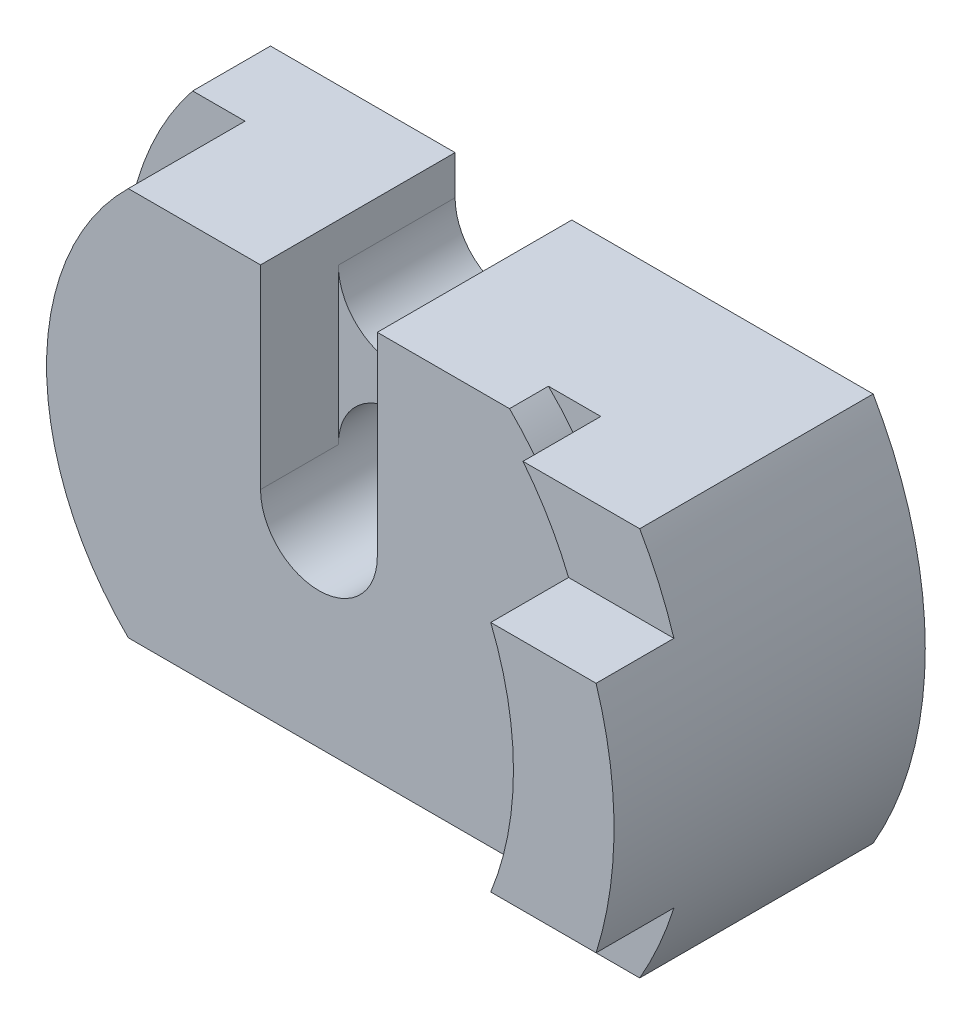
ISO-10303-21;
HEADER;
FILE_DESCRIPTION(('STEP AP214'),'2;1');
FILE_NAME('part.step','',(''),(''),'','','');
FILE_SCHEMA(('AUTOMOTIVE_DESIGN { 1 0 10303 214 1 1 1 1 }'));
ENDSEC;
DATA;
#1=APPLICATION_CONTEXT('core data for automotive mechanical design processes');
#2=APPLICATION_PROTOCOL_DEFINITION('international standard','automotive_design',2000,#1);
#3=PRODUCT_CONTEXT('',#1,'mechanical');
#4=PRODUCT('Part','Part','',(#3));
#5=PRODUCT_RELATED_PRODUCT_CATEGORY('part','',(#4));
#6=PRODUCT_DEFINITION_FORMATION('','',#4);
#7=PRODUCT_DEFINITION_CONTEXT('part definition',#1,'design');
#8=PRODUCT_DEFINITION('design','',#6,#7);
#9=PRODUCT_DEFINITION_SHAPE('','',#8);
#10=(LENGTH_UNIT() NAMED_UNIT(*) SI_UNIT(.MILLI.,.METRE.));
#11=(NAMED_UNIT(*) PLANE_ANGLE_UNIT() SI_UNIT($,.RADIAN.));
#12=(NAMED_UNIT(*) SI_UNIT($,.STERADIAN.) SOLID_ANGLE_UNIT());
#13=UNCERTAINTY_MEASURE_WITH_UNIT(LENGTH_MEASURE(1.E-05),#10,'distance_accuracy_value','');
#14=(GEOMETRIC_REPRESENTATION_CONTEXT(3) GLOBAL_UNCERTAINTY_ASSIGNED_CONTEXT((#13)) GLOBAL_UNIT_ASSIGNED_CONTEXT((#10,
#11,#12)) REPRESENTATION_CONTEXT('',''));
#15=CARTESIAN_POINT('',(0.,0.,0.));
#16=DIRECTION('',(0.,0.,1.));
#17=DIRECTION('',(1.,0.,0.));
#18=AXIS2_PLACEMENT_3D('',#15,#16,#17);
#19=CARTESIAN_POINT('',(0.,0.,5.));
#20=DIRECTION('',(0.,0.,-1.));
#21=DIRECTION('',(-1.,0.,0.));
#22=AXIS2_PLACEMENT_3D('',#19,#20,#21);
#23=CYLINDRICAL_SURFACE('',#22,7.);
#24=CARTESIAN_POINT('',(0.,0.,4.));
#25=DIRECTION('',(0.,0.,-1.));
#26=DIRECTION('',(-1.,0.,0.));
#27=AXIS2_PLACEMENT_3D('',#24,#25,#26);
#28=CIRCLE('',#27,7.00000000000004);
#29=CARTESIAN_POINT('',(4.89897948556636,5.,4.));
#30=VERTEX_POINT('',#29);
#31=CARTESIAN_POINT('',(4.89897948556635,-5.,4.));
#32=VERTEX_POINT('',#31);
#33=EDGE_CURVE('E178',#30,#32,#28,.T.);
#34=ORIENTED_EDGE('',*,*,#33,.F.);
#35=DIRECTION('',(0.,0.,-1.));
#36=VECTOR('',#35,1.);
#37=CARTESIAN_POINT('',(4.89897948556636,5.,5.));
#38=LINE('',#37,#36);
#39=CARTESIAN_POINT('',(4.89897948556636,5.,5.));
#40=VERTEX_POINT('',#39);
#41=EDGE_CURVE('E190',#40,#30,#38,.T.);
#42=ORIENTED_EDGE('',*,*,#41,.F.);
#43=CARTESIAN_POINT('',(0.,0.,5.));
#44=DIRECTION('',(0.,0.,1.));
#45=DIRECTION('',(1.,0.,0.));
#46=AXIS2_PLACEMENT_3D('',#43,#44,#45);
#47=CIRCLE('',#46,7.);
#48=CARTESIAN_POINT('',(4.89897948556635,-5.,5.));
#49=VERTEX_POINT('',#48);
#50=EDGE_CURVE('E188',#49,#40,#47,.T.);
#51=ORIENTED_EDGE('',*,*,#50,.F.);
#52=DIRECTION('',(0.,0.,-1.));
#53=VECTOR('',#52,1.);
#54=CARTESIAN_POINT('',(4.89897948556635,-5.,5.));
#55=LINE('',#54,#53);
#56=EDGE_CURVE('E173',#49,#32,#55,.T.);
#57=ORIENTED_EDGE('',*,*,#56,.T.);
#58=EDGE_LOOP('',(#34,#42,#51,#57));
#59=FACE_BOUND('',#58,.T.);
#60=ADVANCED_FACE('F33',(#59),#23,.T.);
#61=CARTESIAN_POINT('',(0.,0.,6.));
#62=DIRECTION('',(0.,0.,-1.));
#63=DIRECTION('',(-1.,0.,0.));
#64=AXIS2_PLACEMENT_3D('',#61,#62,#63);
#65=CYLINDRICAL_SURFACE('',#64,8.00000000000001);
#66=DIRECTION('',(0.,0.,-1.));
#67=VECTOR('',#66,1.);
#68=CARTESIAN_POINT('',(6.2449979983984,5.,6.));
#69=LINE('',#68,#67);
#70=CARTESIAN_POINT('',(6.2449979983984,5.,6.));
#71=VERTEX_POINT('',#70);
#72=CARTESIAN_POINT('',(6.2449979983984,5.,4.));
#73=VERTEX_POINT('',#72);
#74=EDGE_CURVE('E256',#71,#73,#69,.T.);
#75=ORIENTED_EDGE('',*,*,#74,.T.);
#76=CARTESIAN_POINT('',(0.,0.,4.));
#77=DIRECTION('',(0.,0.,1.));
#78=DIRECTION('',(-1.,0.,0.));
#79=AXIS2_PLACEMENT_3D('',#76,#77,#78);
#80=CIRCLE('',#79,8.00000000000005);
#81=CARTESIAN_POINT('',(6.2449979983984,-5.,4.));
#82=VERTEX_POINT('',#81);
#83=EDGE_CURVE('E177',#82,#73,#80,.T.);
#84=ORIENTED_EDGE('',*,*,#83,.F.);
#85=DIRECTION('',(0.,0.,-1.));
#86=VECTOR('',#85,1.);
#87=CARTESIAN_POINT('',(6.2449979983984,-5.,6.));
#88=LINE('',#87,#86);
#89=CARTESIAN_POINT('',(6.2449979983984,-5.,6.));
#90=VERTEX_POINT('',#89);
#91=EDGE_CURVE('E176',#90,#82,#88,.T.);
#92=ORIENTED_EDGE('',*,*,#91,.F.);
#93=CARTESIAN_POINT('',(0.,0.,6.));
#94=DIRECTION('',(0.,0.,1.));
#95=DIRECTION('',(-1.,0.,0.));
#96=AXIS2_PLACEMENT_3D('',#93,#94,#95);
#97=CIRCLE('',#96,8.00000000000001);
#98=CARTESIAN_POINT('',(7.41619848709566,-3.,6.));
#99=VERTEX_POINT('',#98);
#100=EDGE_CURVE('E241',#90,#99,#97,.T.);
#101=ORIENTED_EDGE('',*,*,#100,.T.);
#102=DIRECTION('',(0.,0.,-1.));
#103=VECTOR('',#102,1.);
#104=CARTESIAN_POINT('',(7.41619848709566,-3.,8.));
#105=LINE('',#104,#103);
#106=CARTESIAN_POINT('',(7.41619848709566,-3.,8.));
#107=VERTEX_POINT('',#106);
#108=EDGE_CURVE('E239',#107,#99,#105,.T.);
#109=ORIENTED_EDGE('',*,*,#108,.F.);
#110=CARTESIAN_POINT('',(-1.36175792864179E-13,0.,8.));
#111=DIRECTION('',(0.,0.,-1.));
#112=DIRECTION('',(-1.,0.,0.));
#113=AXIS2_PLACEMENT_3D('',#110,#111,#112);
#114=CIRCLE('',#113,8.00000000000013);
#115=CARTESIAN_POINT('',(7.41619848709566,3.,8.));
#116=VERTEX_POINT('',#115);
#117=EDGE_CURVE('E315',#116,#107,#114,.T.);
#118=ORIENTED_EDGE('',*,*,#117,.F.);
#119=DIRECTION('',(0.,0.,-1.));
#120=VECTOR('',#119,1.);
#121=CARTESIAN_POINT('',(7.41619848709566,3.,8.));
#122=LINE('',#121,#120);
#123=CARTESIAN_POINT('',(7.41619848709566,3.,6.));
#124=VERTEX_POINT('',#123);
#125=EDGE_CURVE('E325',#116,#124,#122,.T.);
#126=ORIENTED_EDGE('',*,*,#125,.T.);
#127=EDGE_CURVE('E238',#124,#71,#97,.T.);
#128=ORIENTED_EDGE('',*,*,#127,.T.);
#129=EDGE_LOOP('',(#75,#84,#92,#101,#109,#118,#126,#128));
#130=FACE_BOUND('',#129,.T.);
#131=ADVANCED_FACE('F354',(#130),#65,.F.);
#132=CARTESIAN_POINT('',(-6.2449979983984,5.,2.));
#133=DIRECTION('',(0.,-1.,0.));
#134=DIRECTION('',(0.,0.,-1.));
#135=AXIS2_PLACEMENT_3D('',#132,#133,#134);
#136=PLANE('',#135);
#137=DIRECTION('',(0.,0.,1.));
#138=VECTOR('',#137,1.);
#139=CARTESIAN_POINT('',(-1.49999999999981,5.,3.));
#140=LINE('',#139,#138);
#141=CARTESIAN_POINT('',(-1.49999999999981,5.,0.));
#142=VERTEX_POINT('',#141);
#143=CARTESIAN_POINT('',(-1.49999999999981,5.,5.));
#144=VERTEX_POINT('',#143);
#145=EDGE_CURVE('E305',#142,#144,#140,.T.);
#146=ORIENTED_EDGE('',*,*,#145,.F.);
#147=DIRECTION('',(-1.,0.,0.));
#148=VECTOR('',#147,1.);
#149=CARTESIAN_POINT('',(-6.2449979983984,5.,0.));
#150=LINE('',#149,#148);
#151=CARTESIAN_POINT('',(-6.2449979983984,5.,0.));
#152=VERTEX_POINT('',#151);
#153=EDGE_CURVE('E215',#142,#152,#150,.T.);
#154=ORIENTED_EDGE('',*,*,#153,.T.);
#155=DIRECTION('',(0.,0.,-1.));
#156=VECTOR('',#155,1.);
#157=CARTESIAN_POINT('',(-6.2449979983984,5.,2.));
#158=LINE('',#157,#156);
#159=CARTESIAN_POINT('',(-6.2449979983984,5.,2.));
#160=VERTEX_POINT('',#159);
#161=EDGE_CURVE('E210',#160,#152,#158,.T.);
#162=ORIENTED_EDGE('',*,*,#161,.F.);
#163=DIRECTION('',(-1.,0.,0.));
#164=VECTOR('',#163,1.);
#165=CARTESIAN_POINT('',(-6.2449979983984,5.,2.));
#166=LINE('',#165,#164);
#167=CARTESIAN_POINT('',(-4.89897948556636,5.,2.));
#168=VERTEX_POINT('',#167);
#169=EDGE_CURVE('E208',#168,#160,#166,.T.);
#170=ORIENTED_EDGE('',*,*,#169,.F.);
#171=DIRECTION('',(0.,0.,-1.));
#172=VECTOR('',#171,1.);
#173=CARTESIAN_POINT('',(-4.89897948556636,5.,5.));
#174=LINE('',#173,#172);
#175=CARTESIAN_POINT('',(-4.89897948556636,5.,5.));
#176=VERTEX_POINT('',#175);
#177=EDGE_CURVE('E195',#176,#168,#174,.T.);
#178=ORIENTED_EDGE('',*,*,#177,.F.);
#179=DIRECTION('',(-1.,0.,0.));
#180=VECTOR('',#179,1.);
#181=CARTESIAN_POINT('',(4.89897948556636,5.,5.));
#182=LINE('',#181,#180);
#183=EDGE_CURVE('E268',#144,#176,#182,.T.);
#184=ORIENTED_EDGE('',*,*,#183,.F.);
#185=EDGE_LOOP('',(#146,#154,#162,#170,#178,#184));
#186=FACE_BOUND('',#185,.T.);
#187=ADVANCED_FACE('F282',(#186),#136,.F.);
#188=CARTESIAN_POINT('',(0.,0.,6.));
#189=DIRECTION('',(0.,0.,-1.));
#190=DIRECTION('',(-1.,0.,0.));
#191=AXIS2_PLACEMENT_3D('',#188,#189,#190);
#192=PLANE('',#191);
#193=DIRECTION('',(-1.,0.,0.));
#194=VECTOR('',#193,1.);
#195=CARTESIAN_POINT('',(7.41619848709566,3.,6.));
#196=LINE('',#195,#194);
#197=CARTESIAN_POINT('',(10.1241359747235,3.,6.));
#198=VERTEX_POINT('',#197);
#199=EDGE_CURVE('E319',#198,#124,#196,.T.);
#200=ORIENTED_EDGE('',*,*,#199,.F.);
#201=CARTESIAN_POINT('',(0.584743960553993,0.,6.));
#202=DIRECTION('',(0.,0.,-1.));
#203=DIRECTION('',(-1.,0.,0.));
#204=AXIS2_PLACEMENT_3D('',#201,#202,#203);
#205=CIRCLE('',#204,10.);
#206=CARTESIAN_POINT('',(9.2449979983984,5.,6.));
#207=VERTEX_POINT('',#206);
#208=EDGE_CURVE('E341',#207,#198,#205,.T.);
#209=ORIENTED_EDGE('',*,*,#208,.F.);
#210=DIRECTION('',(1.,0.,0.));
#211=VECTOR('',#210,1.);
#212=CARTESIAN_POINT('',(6.2449979983984,5.,6.));
#213=LINE('',#212,#211);
#214=EDGE_CURVE('E338',#71,#207,#213,.T.);
#215=ORIENTED_EDGE('',*,*,#214,.F.);
#216=ORIENTED_EDGE('',*,*,#127,.F.);
#217=EDGE_LOOP('',(#200,#209,#215,#216));
#218=FACE_BOUND('',#217,.T.);
#219=ADVANCED_FACE('F366',(#218),#192,.F.);
#220=DIRECTION('',(1.,0.,0.));
#221=VECTOR('',#220,1.);
#222=CARTESIAN_POINT('',(7.41619848709566,-3.,6.));
#223=LINE('',#222,#221);
#224=CARTESIAN_POINT('',(10.1241359747234,-3.,6.));
#225=VERTEX_POINT('',#224);
#226=EDGE_CURVE('E307',#99,#225,#223,.T.);
#227=ORIENTED_EDGE('',*,*,#226,.F.);
#228=ORIENTED_EDGE('',*,*,#100,.F.);
#229=DIRECTION('',(-1.,0.,0.));
#230=VECTOR('',#229,1.);
#231=CARTESIAN_POINT('',(6.2449979983984,-5.,6.));
#232=LINE('',#231,#230);
#233=CARTESIAN_POINT('',(9.24499799839836,-5.,6.));
#234=VERTEX_POINT('',#233);
#235=EDGE_CURVE('E248',#234,#90,#232,.T.);
#236=ORIENTED_EDGE('',*,*,#235,.F.);
#237=EDGE_CURVE('E340',#225,#234,#205,.T.);
#238=ORIENTED_EDGE('',*,*,#237,.F.);
#239=EDGE_LOOP('',(#227,#228,#236,#238));
#240=FACE_BOUND('',#239,.T.);
#241=ADVANCED_FACE('F351',(#240),#192,.F.);
#242=CARTESIAN_POINT('',(0.,0.,2.));
#243=DIRECTION('',(0.,0.,1.));
#244=DIRECTION('',(1.,0.,0.));
#245=AXIS2_PLACEMENT_3D('',#242,#243,#244);
#246=PLANE('',#245);
#247=CARTESIAN_POINT('',(0.,0.,2.));
#248=DIRECTION('',(0.,0.,1.));
#249=DIRECTION('',(1.,0.,0.));
#250=AXIS2_PLACEMENT_3D('',#247,#248,#249);
#251=CIRCLE('',#250,7.);
#252=CARTESIAN_POINT('',(-4.89897948556636,-5.,2.));
#253=VERTEX_POINT('',#252);
#254=EDGE_CURVE('E261',#168,#253,#251,.T.);
#255=ORIENTED_EDGE('',*,*,#254,.F.);
#256=ORIENTED_EDGE('',*,*,#169,.T.);
#257=CARTESIAN_POINT('',(0.,0.,2.));
#258=DIRECTION('',(0.,0.,1.));
#259=DIRECTION('',(1.,0.,0.));
#260=AXIS2_PLACEMENT_3D('',#257,#258,#259);
#261=CIRCLE('',#260,8.);
#262=CARTESIAN_POINT('',(-6.2449979983984,-5.,2.));
#263=VERTEX_POINT('',#262);
#264=EDGE_CURVE('E202',#160,#263,#261,.T.);
#265=ORIENTED_EDGE('',*,*,#264,.T.);
#266=DIRECTION('',(1.,0.,0.));
#267=VECTOR('',#266,1.);
#268=CARTESIAN_POINT('',(-6.2449979983984,-5.,2.));
#269=LINE('',#268,#267);
#270=EDGE_CURVE('E205',#263,#253,#269,.T.);
#271=ORIENTED_EDGE('',*,*,#270,.T.);
#272=EDGE_LOOP('',(#255,#256,#265,#271));
#273=FACE_BOUND('',#272,.T.);
#274=ADVANCED_FACE('F284',(#273),#246,.T.);
#275=CARTESIAN_POINT('',(0.,0.,0.));
#276=DIRECTION('',(0.,0.,1.));
#277=DIRECTION('',(1.,0.,0.));
#278=AXIS2_PLACEMENT_3D('',#275,#276,#277);
#279=PLANE('',#278);
#280=ORIENTED_EDGE('',*,*,#153,.F.);
#281=DIRECTION('',(0.,-1.,0.));
#282=VECTOR('',#281,1.);
#283=CARTESIAN_POINT('',(-1.49999999999981,0.,0.));
#284=LINE('',#283,#282);
#285=CARTESIAN_POINT('',(-1.49999999999981,3.99519836107406,0.));
#286=VERTEX_POINT('',#285);
#287=EDGE_CURVE('E295',#142,#286,#284,.T.);
#288=ORIENTED_EDGE('',*,*,#287,.T.);
#289=CARTESIAN_POINT('',(1.88759809987963E-13,3.99519836107406,0.));
#290=DIRECTION('',(0.,0.,1.));
#291=DIRECTION('',(1.,0.,0.));
#292=AXIS2_PLACEMENT_3D('',#289,#290,#291);
#293=CIRCLE('',#292,1.5);
#294=CARTESIAN_POINT('',(1.50000000000019,3.99519836107406,0.));
#295=VERTEX_POINT('',#294);
#296=EDGE_CURVE('E377',#286,#295,#293,.T.);
#297=ORIENTED_EDGE('',*,*,#296,.T.);
#298=DIRECTION('',(1.879654761002E-13,1.,0.));
#299=VECTOR('',#298,1.);
#300=CARTESIAN_POINT('',(1.49999999999944,-2.81948214150194E-13,0.));
#301=LINE('',#300,#299);
#302=CARTESIAN_POINT('',(1.50000000000038,5.,0.));
#303=VERTEX_POINT('',#302);
#304=EDGE_CURVE('E299',#295,#303,#301,.T.);
#305=ORIENTED_EDGE('',*,*,#304,.T.);
#306=CARTESIAN_POINT('',(9.2449979983984,5.,0.));
#307=VERTEX_POINT('',#306);
#308=EDGE_CURVE('E206',#307,#303,#150,.T.);
#309=ORIENTED_EDGE('',*,*,#308,.F.);
#310=CARTESIAN_POINT('',(0.584743960553993,0.,0.));
#311=DIRECTION('',(0.,0.,-1.));
#312=DIRECTION('',(-1.,0.,0.));
#313=AXIS2_PLACEMENT_3D('',#310,#311,#312);
#314=CIRCLE('',#313,10.);
#315=CARTESIAN_POINT('',(9.24499799839836,-5.,0.));
#316=VERTEX_POINT('',#315);
#317=EDGE_CURVE('E234',#307,#316,#314,.T.);
#318=ORIENTED_EDGE('',*,*,#317,.T.);
#319=DIRECTION('',(1.,0.,0.));
#320=VECTOR('',#319,1.);
#321=CARTESIAN_POINT('',(-6.2449979983984,-5.,0.));
#322=LINE('',#321,#320);
#323=CARTESIAN_POINT('',(-6.2449979983984,-5.,0.));
#324=VERTEX_POINT('',#323);
#325=EDGE_CURVE('E213',#324,#316,#322,.T.);
#326=ORIENTED_EDGE('',*,*,#325,.F.);
#327=CARTESIAN_POINT('',(0.,0.,0.));
#328=DIRECTION('',(0.,0.,1.));
#329=DIRECTION('',(1.,0.,0.));
#330=AXIS2_PLACEMENT_3D('',#327,#328,#329);
#331=CIRCLE('',#330,8.);
#332=EDGE_CURVE('E201',#152,#324,#331,.T.);
#333=ORIENTED_EDGE('',*,*,#332,.F.);
#334=EDGE_LOOP('',(#280,#288,#297,#305,#309,#318,#326,#333));
#335=FACE_BOUND('',#334,.T.);
#336=CARTESIAN_POINT('',(0.,0.,0.));
#337=DIRECTION('',(0.,0.,1.));
#338=DIRECTION('',(1.,0.,0.));
#339=AXIS2_PLACEMENT_3D('',#336,#337,#338);
#340=CIRCLE('',#339,1.5);
#341=CARTESIAN_POINT('',(1.5,0.,0.));
#342=VERTEX_POINT('',#341);
#343=EDGE_CURVE('E193',#342,#342,#340,.T.);
#344=ORIENTED_EDGE('',*,*,#343,.T.);
#345=EDGE_LOOP('',(#344));
#346=FACE_BOUND('',#345,.T.);
#347=ADVANCED_FACE('F229',(#335,#346),#279,.F.);
#348=CARTESIAN_POINT('',(0.,0.,2.));
#349=DIRECTION('',(0.,0.,-1.));
#350=DIRECTION('',(-1.,0.,0.));
#351=AXIS2_PLACEMENT_3D('',#348,#349,#350);
#352=CYLINDRICAL_SURFACE('',#351,8.);
#353=ORIENTED_EDGE('',*,*,#332,.T.);
#354=DIRECTION('',(0.,0.,-1.));
#355=VECTOR('',#354,1.);
#356=CARTESIAN_POINT('',(-6.2449979983984,-5.,2.));
#357=LINE('',#356,#355);
#358=EDGE_CURVE('E41',#263,#324,#357,.T.);
#359=ORIENTED_EDGE('',*,*,#358,.F.);
#360=ORIENTED_EDGE('',*,*,#264,.F.);
#361=ORIENTED_EDGE('',*,*,#161,.T.);
#362=EDGE_LOOP('',(#353,#359,#360,#361));
#363=FACE_BOUND('',#362,.T.);
#364=ADVANCED_FACE('F35',(#363),#352,.T.);
#365=CARTESIAN_POINT('',(-6.2449979983984,-5.,2.));
#366=DIRECTION('',(0.,1.,0.));
#367=DIRECTION('',(0.,0.,1.));
#368=AXIS2_PLACEMENT_3D('',#365,#366,#367);
#369=PLANE('',#368);
#370=ORIENTED_EDGE('',*,*,#325,.T.);
#371=DIRECTION('',(0.,0.,-1.));
#372=VECTOR('',#371,1.);
#373=CARTESIAN_POINT('',(9.24499799839836,-5.,6.));
#374=LINE('',#373,#372);
#375=EDGE_CURVE('E252',#234,#316,#374,.T.);
#376=ORIENTED_EDGE('',*,*,#375,.F.);
#377=ORIENTED_EDGE('',*,*,#235,.T.);
#378=ORIENTED_EDGE('',*,*,#91,.T.);
#379=DIRECTION('',(1.,0.,0.));
#380=VECTOR('',#379,1.);
#381=CARTESIAN_POINT('',(4.89897948556635,-5.,4.));
#382=LINE('',#381,#380);
#383=EDGE_CURVE('E48',#32,#82,#382,.T.);
#384=ORIENTED_EDGE('',*,*,#383,.F.);
#385=ORIENTED_EDGE('',*,*,#56,.F.);
#386=DIRECTION('',(1.,0.,0.));
#387=VECTOR('',#386,1.);
#388=CARTESIAN_POINT('',(-4.89897948556636,-5.,5.));
#389=LINE('',#388,#387);
#390=CARTESIAN_POINT('',(-4.89897948556636,-5.,5.));
#391=VERTEX_POINT('',#390);
#392=EDGE_CURVE('E265',#391,#49,#389,.T.);
#393=ORIENTED_EDGE('',*,*,#392,.F.);
#394=DIRECTION('',(0.,0.,-1.));
#395=VECTOR('',#394,1.);
#396=CARTESIAN_POINT('',(-4.89897948556636,-5.,5.));
#397=LINE('',#396,#395);
#398=EDGE_CURVE('E189',#391,#253,#397,.T.);
#399=ORIENTED_EDGE('',*,*,#398,.T.);
#400=ORIENTED_EDGE('',*,*,#270,.F.);
#401=ORIENTED_EDGE('',*,*,#358,.T.);
#402=EDGE_LOOP('',(#370,#376,#377,#378,#384,#385,#393,#399,#400,#401));
#403=FACE_BOUND('',#402,.T.);
#404=ADVANCED_FACE('F171',(#403),#369,.F.);
#405=ORIENTED_EDGE('',*,*,#308,.T.);
#406=DIRECTION('',(0.,0.,1.));
#407=VECTOR('',#406,1.);
#408=CARTESIAN_POINT('',(1.50000000000038,5.,3.));
#409=LINE('',#408,#407);
#410=CARTESIAN_POINT('',(1.50000000000038,5.,5.));
#411=VERTEX_POINT('',#410);
#412=EDGE_CURVE('E308',#303,#411,#409,.T.);
#413=ORIENTED_EDGE('',*,*,#412,.T.);
#414=EDGE_CURVE('E269',#40,#411,#182,.T.);
#415=ORIENTED_EDGE('',*,*,#414,.F.);
#416=ORIENTED_EDGE('',*,*,#41,.T.);
#417=DIRECTION('',(-1.,0.,0.));
#418=VECTOR('',#417,1.);
#419=CARTESIAN_POINT('',(4.89897948556636,5.,4.));
#420=LINE('',#419,#418);
#421=EDGE_CURVE('E183',#73,#30,#420,.T.);
#422=ORIENTED_EDGE('',*,*,#421,.F.);
#423=ORIENTED_EDGE('',*,*,#74,.F.);
#424=ORIENTED_EDGE('',*,*,#214,.T.);
#425=DIRECTION('',(0.,0.,-1.));
#426=VECTOR('',#425,1.);
#427=CARTESIAN_POINT('',(9.2449979983984,5.,6.));
#428=LINE('',#427,#426);
#429=EDGE_CURVE('E254',#207,#307,#428,.T.);
#430=ORIENTED_EDGE('',*,*,#429,.T.);
#431=EDGE_LOOP('',(#405,#413,#415,#416,#422,#423,#424,#430));
#432=FACE_BOUND('',#431,.T.);
#433=ADVANCED_FACE('F369',(#432),#136,.F.);
#434=CARTESIAN_POINT('',(0.,0.,2.));
#435=DIRECTION('',(0.,0.,-1.));
#436=DIRECTION('',(-1.,0.,0.));
#437=AXIS2_PLACEMENT_3D('',#434,#435,#436);
#438=CYLINDRICAL_SURFACE('',#437,1.5);
#439=DIRECTION('',(0.,0.,1.));
#440=VECTOR('',#439,1.);
#441=CARTESIAN_POINT('',(-1.5,1.13581019589581E-13,3.));
#442=LINE('',#441,#440);
#443=CARTESIAN_POINT('',(-1.5,1.13581019589581E-13,3.));
#444=VERTEX_POINT('',#443);
#445=CARTESIAN_POINT('',(-1.5,1.13581019589581E-13,5.));
#446=VERTEX_POINT('',#445);
#447=EDGE_CURVE('E313',#444,#446,#442,.T.);
#448=ORIENTED_EDGE('',*,*,#447,.T.);
#449=CARTESIAN_POINT('',(0.,0.,5.));
#450=DIRECTION('',(0.,0.,1.));
#451=DIRECTION('',(1.,0.,0.));
#452=AXIS2_PLACEMENT_3D('',#449,#450,#451);
#453=CIRCLE('',#452,1.5);
#454=CARTESIAN_POINT('',(1.5,0.,5.));
#455=VERTEX_POINT('',#454);
#456=EDGE_CURVE('E251',#446,#455,#453,.T.);
#457=ORIENTED_EDGE('',*,*,#456,.T.);
#458=DIRECTION('',(0.,0.,1.));
#459=VECTOR('',#458,1.);
#460=CARTESIAN_POINT('',(1.50000000000019,0.,3.));
#461=LINE('',#460,#459);
#462=CARTESIAN_POINT('',(1.50000000000019,0.,3.));
#463=VERTEX_POINT('',#462);
#464=EDGE_CURVE('E311',#463,#455,#461,.T.);
#465=ORIENTED_EDGE('',*,*,#464,.F.);
#466=CARTESIAN_POINT('',(0.,0.,3.));
#467=DIRECTION('',(0.,0.,1.));
#468=DIRECTION('',(1.,0.,0.));
#469=AXIS2_PLACEMENT_3D('',#466,#467,#468);
#470=CIRCLE('',#469,1.5);
#471=EDGE_CURVE('E11',#463,#444,#470,.T.);
#472=ORIENTED_EDGE('',*,*,#471,.T.);
#473=EDGE_LOOP('',(#448,#457,#465,#472));
#474=FACE_BOUND('',#473,.T.);
#475=ORIENTED_EDGE('',*,*,#343,.F.);
#476=EDGE_LOOP('',(#475));
#477=FACE_BOUND('',#476,.T.);
#478=ADVANCED_FACE('F391',(#474,#477),#438,.F.);
#479=CARTESIAN_POINT('',(0.,0.,5.));
#480=DIRECTION('',(0.,0.,1.));
#481=DIRECTION('',(1.,0.,0.));
#482=AXIS2_PLACEMENT_3D('',#479,#480,#481);
#483=PLANE('',#482);
#484=DIRECTION('',(0.,-1.,0.));
#485=VECTOR('',#484,1.);
#486=CARTESIAN_POINT('',(-1.5,1.13581019589581E-13,5.));
#487=LINE('',#486,#485);
#488=EDGE_CURVE('E289',#144,#446,#487,.T.);
#489=ORIENTED_EDGE('',*,*,#488,.F.);
#490=ORIENTED_EDGE('',*,*,#183,.T.);
#491=CARTESIAN_POINT('',(0.,0.,5.));
#492=DIRECTION('',(0.,0.,1.));
#493=DIRECTION('',(1.,0.,0.));
#494=AXIS2_PLACEMENT_3D('',#491,#492,#493);
#495=CIRCLE('',#494,7.);
#496=EDGE_CURVE('E262',#176,#391,#495,.T.);
#497=ORIENTED_EDGE('',*,*,#496,.T.);
#498=ORIENTED_EDGE('',*,*,#392,.T.);
#499=ORIENTED_EDGE('',*,*,#50,.T.);
#500=ORIENTED_EDGE('',*,*,#414,.T.);
#501=DIRECTION('',(0.,1.,0.));
#502=VECTOR('',#501,1.);
#503=CARTESIAN_POINT('',(1.50000000000038,0.,5.));
#504=LINE('',#503,#502);
#505=EDGE_CURVE('E294',#455,#411,#504,.T.);
#506=ORIENTED_EDGE('',*,*,#505,.F.);
#507=ORIENTED_EDGE('',*,*,#456,.F.);
#508=EDGE_LOOP('',(#489,#490,#497,#498,#499,#500,#506,#507));
#509=FACE_BOUND('',#508,.T.);
#510=ADVANCED_FACE('F287',(#509),#483,.T.);
#511=CARTESIAN_POINT('',(0.,0.,5.));
#512=DIRECTION('',(0.,0.,-1.));
#513=DIRECTION('',(-1.,0.,0.));
#514=AXIS2_PLACEMENT_3D('',#511,#512,#513);
#515=CYLINDRICAL_SURFACE('',#514,7.);
#516=ORIENTED_EDGE('',*,*,#254,.T.);
#517=ORIENTED_EDGE('',*,*,#398,.F.);
#518=ORIENTED_EDGE('',*,*,#496,.F.);
#519=ORIENTED_EDGE('',*,*,#177,.T.);
#520=EDGE_LOOP('',(#516,#517,#518,#519));
#521=FACE_BOUND('',#520,.T.);
#522=ADVANCED_FACE('F277',(#521),#515,.T.);
#523=CARTESIAN_POINT('',(0.584743960553993,0.,6.));
#524=DIRECTION('',(0.,0.,-1.));
#525=DIRECTION('',(-1.,0.,0.));
#526=AXIS2_PLACEMENT_3D('',#523,#524,#525);
#527=CYLINDRICAL_SURFACE('',#526,10.);
#528=ORIENTED_EDGE('',*,*,#317,.F.);
#529=ORIENTED_EDGE('',*,*,#429,.F.);
#530=ORIENTED_EDGE('',*,*,#208,.T.);
#531=DIRECTION('',(0.,0.,-1.));
#532=VECTOR('',#531,1.);
#533=CARTESIAN_POINT('',(10.1241359747235,3.,8.));
#534=LINE('',#533,#532);
#535=CARTESIAN_POINT('',(10.1241359747235,3.,8.));
#536=VERTEX_POINT('',#535);
#537=EDGE_CURVE('E332',#536,#198,#534,.T.);
#538=ORIENTED_EDGE('',*,*,#537,.F.);
#539=CARTESIAN_POINT('',(0.584743960553911,0.,8.));
#540=DIRECTION('',(0.,0.,1.));
#541=DIRECTION('',(-1.,0.,0.));
#542=AXIS2_PLACEMENT_3D('',#539,#540,#541);
#543=CIRCLE('',#542,10.0000000000001);
#544=CARTESIAN_POINT('',(10.1241359747234,-3.,8.));
#545=VERTEX_POINT('',#544);
#546=EDGE_CURVE('E321',#545,#536,#543,.T.);
#547=ORIENTED_EDGE('',*,*,#546,.F.);
#548=DIRECTION('',(0.,0.,-1.));
#549=VECTOR('',#548,1.);
#550=CARTESIAN_POINT('',(10.1241359747234,-3.,8.));
#551=LINE('',#550,#549);
#552=EDGE_CURVE('E244',#545,#225,#551,.T.);
#553=ORIENTED_EDGE('',*,*,#552,.T.);
#554=ORIENTED_EDGE('',*,*,#237,.T.);
#555=ORIENTED_EDGE('',*,*,#375,.T.);
#556=EDGE_LOOP('',(#528,#529,#530,#538,#547,#553,#554,#555));
#557=FACE_BOUND('',#556,.T.);
#558=ADVANCED_FACE('F345',(#557),#527,.T.);
#559=CARTESIAN_POINT('',(7.41619848709566,-3.,8.));
#560=DIRECTION('',(0.,1.,0.));
#561=DIRECTION('',(0.,0.,1.));
#562=AXIS2_PLACEMENT_3D('',#559,#560,#561);
#563=PLANE('',#562);
#564=ORIENTED_EDGE('',*,*,#226,.T.);
#565=ORIENTED_EDGE('',*,*,#552,.F.);
#566=DIRECTION('',(1.,0.,0.));
#567=VECTOR('',#566,1.);
#568=CARTESIAN_POINT('',(7.41619848709566,-3.,8.));
#569=LINE('',#568,#567);
#570=EDGE_CURVE('E318',#107,#545,#569,.T.);
#571=ORIENTED_EDGE('',*,*,#570,.F.);
#572=ORIENTED_EDGE('',*,*,#108,.T.);
#573=EDGE_LOOP('',(#564,#565,#571,#572));
#574=FACE_BOUND('',#573,.T.);
#575=ADVANCED_FACE('F357',(#574),#563,.F.);
#576=CARTESIAN_POINT('',(7.41619848709566,3.,8.));
#577=DIRECTION('',(0.,-1.,0.));
#578=DIRECTION('',(0.,0.,-1.));
#579=AXIS2_PLACEMENT_3D('',#576,#577,#578);
#580=PLANE('',#579);
#581=ORIENTED_EDGE('',*,*,#199,.T.);
#582=ORIENTED_EDGE('',*,*,#125,.F.);
#583=DIRECTION('',(-1.,0.,0.));
#584=VECTOR('',#583,1.);
#585=CARTESIAN_POINT('',(7.41619848709566,3.,8.));
#586=LINE('',#585,#584);
#587=EDGE_CURVE('E323',#536,#116,#586,.T.);
#588=ORIENTED_EDGE('',*,*,#587,.F.);
#589=ORIENTED_EDGE('',*,*,#537,.T.);
#590=EDGE_LOOP('',(#581,#582,#588,#589));
#591=FACE_BOUND('',#590,.T.);
#592=ADVANCED_FACE('F364',(#591),#580,.F.);
#593=CARTESIAN_POINT('',(-1.36175792864179E-13,0.,8.));
#594=DIRECTION('',(0.,0.,-1.));
#595=DIRECTION('',(-1.,0.,0.));
#596=AXIS2_PLACEMENT_3D('',#593,#594,#595);
#597=PLANE('',#596);
#598=ORIENTED_EDGE('',*,*,#117,.T.);
#599=ORIENTED_EDGE('',*,*,#570,.T.);
#600=ORIENTED_EDGE('',*,*,#546,.T.);
#601=ORIENTED_EDGE('',*,*,#587,.T.);
#602=EDGE_LOOP('',(#598,#599,#600,#601));
#603=FACE_BOUND('',#602,.T.);
#604=ADVANCED_FACE('F359',(#603),#597,.F.);
#605=CARTESIAN_POINT('',(-1.5,1.13581019589581E-13,3.));
#606=DIRECTION('',(-1.,0.,0.));
#607=DIRECTION('',(0.,-1.,0.));
#608=AXIS2_PLACEMENT_3D('',#605,#606,#607);
#609=PLANE('',#608);
#610=ORIENTED_EDGE('',*,*,#488,.T.);
#611=ORIENTED_EDGE('',*,*,#447,.F.);
#612=DIRECTION('',(0.,-1.,0.));
#613=VECTOR('',#612,1.);
#614=CARTESIAN_POINT('',(-1.5,1.13581019589581E-13,3.));
#615=LINE('',#614,#613);
#616=CARTESIAN_POINT('',(-1.4999999999997,3.99519836107418,3.));
#617=VERTEX_POINT('',#616);
#618=EDGE_CURVE('E297',#617,#444,#615,.T.);
#619=ORIENTED_EDGE('',*,*,#618,.F.);
#620=DIRECTION('',(0.,0.,1.));
#621=VECTOR('',#620,1.);
#622=CARTESIAN_POINT('',(-1.49999999999981,3.99519836107406,-1.));
#623=LINE('',#622,#621);
#624=EDGE_CURVE('E56',#286,#617,#623,.T.);
#625=ORIENTED_EDGE('',*,*,#624,.F.);
#626=ORIENTED_EDGE('',*,*,#287,.F.);
#627=ORIENTED_EDGE('',*,*,#145,.T.);
#628=EDGE_LOOP('',(#610,#611,#619,#625,#626,#627));
#629=FACE_BOUND('',#628,.T.);
#630=ADVANCED_FACE('F393',(#629),#609,.F.);
#631=CARTESIAN_POINT('',(1.50000000000038,0.,3.));
#632=DIRECTION('',(1.,0.,0.));
#633=DIRECTION('',(0.,1.,0.));
#634=AXIS2_PLACEMENT_3D('',#631,#632,#633);
#635=PLANE('',#634);
#636=ORIENTED_EDGE('',*,*,#505,.T.);
#637=ORIENTED_EDGE('',*,*,#412,.F.);
#638=ORIENTED_EDGE('',*,*,#304,.F.);
#639=DIRECTION('',(0.,0.,1.));
#640=VECTOR('',#639,1.);
#641=CARTESIAN_POINT('',(1.50000000000019,3.99519836107406,-1.));
#642=LINE('',#641,#640);
#643=CARTESIAN_POINT('',(1.50000000000019,3.99519836107406,3.));
#644=VERTEX_POINT('',#643);
#645=EDGE_CURVE('E375',#295,#644,#642,.T.);
#646=ORIENTED_EDGE('',*,*,#645,.T.);
#647=DIRECTION('',(0.,1.,0.));
#648=VECTOR('',#647,1.);
#649=CARTESIAN_POINT('',(1.50000000000038,0.,3.));
#650=LINE('',#649,#648);
#651=EDGE_CURVE('E302',#463,#644,#650,.T.);
#652=ORIENTED_EDGE('',*,*,#651,.F.);
#653=ORIENTED_EDGE('',*,*,#464,.T.);
#654=EDGE_LOOP('',(#636,#637,#638,#646,#652,#653));
#655=FACE_BOUND('',#654,.T.);
#656=ADVANCED_FACE('F388',(#655),#635,.F.);
#657=CARTESIAN_POINT('',(0.,0.,3.));
#658=DIRECTION('',(0.,0.,1.));
#659=DIRECTION('',(1.,0.,0.));
#660=AXIS2_PLACEMENT_3D('',#657,#658,#659);
#661=PLANE('',#660);
#662=CARTESIAN_POINT('',(1.88759809987963E-13,3.99519836107406,3.));
#663=DIRECTION('',(0.,0.,1.));
#664=DIRECTION('',(-1.,0.,0.));
#665=AXIS2_PLACEMENT_3D('',#662,#663,#664);
#666=CIRCLE('',#665,1.5);
#667=EDGE_CURVE('E371',#617,#644,#666,.T.);
#668=ORIENTED_EDGE('',*,*,#667,.F.);
#669=ORIENTED_EDGE('',*,*,#618,.T.);
#670=ORIENTED_EDGE('',*,*,#471,.F.);
#671=ORIENTED_EDGE('',*,*,#651,.T.);
#672=EDGE_LOOP('',(#668,#669,#670,#671));
#673=FACE_BOUND('',#672,.T.);
#674=ADVANCED_FACE('F385',(#673),#661,.T.);
#675=CARTESIAN_POINT('',(1.88759809987963E-13,3.99519836107406,-1.));
#676=DIRECTION('',(0.,0.,1.));
#677=DIRECTION('',(1.,0.,0.));
#678=AXIS2_PLACEMENT_3D('',#675,#676,#677);
#679=CYLINDRICAL_SURFACE('',#678,1.5);
#680=ORIENTED_EDGE('',*,*,#624,.T.);
#681=ORIENTED_EDGE('',*,*,#667,.T.);
#682=ORIENTED_EDGE('',*,*,#645,.F.);
#683=ORIENTED_EDGE('',*,*,#296,.F.);
#684=EDGE_LOOP('',(#680,#681,#682,#683));
#685=FACE_BOUND('',#684,.T.);
#686=ADVANCED_FACE('F395',(#685),#679,.F.);
#687=CARTESIAN_POINT('',(0.,0.,4.));
#688=DIRECTION('',(0.,0.,-1.));
#689=DIRECTION('',(-1.,0.,0.));
#690=AXIS2_PLACEMENT_3D('',#687,#688,#689);
#691=PLANE('',#690);
#692=ORIENTED_EDGE('',*,*,#33,.T.);
#693=ORIENTED_EDGE('',*,*,#383,.T.);
#694=ORIENTED_EDGE('',*,*,#83,.T.);
#695=ORIENTED_EDGE('',*,*,#421,.T.);
#696=EDGE_LOOP('',(#692,#693,#694,#695));
#697=FACE_BOUND('',#696,.T.);
#698=ADVANCED_FACE('F181',(#697),#691,.F.);
#699=CLOSED_SHELL('',(#60,#131,#187,#219,#241,#274,#347,#364,#404,#433,#478,#510,#522,#558,#575,
#592,#604,#630,#656,#674,#686,#698));
#700=MANIFOLD_SOLID_BREP('B2',#699);
#701=ADVANCED_BREP_SHAPE_REPRESENTATION('',(#18,#700),#14);
#702=SHAPE_DEFINITION_REPRESENTATION(#9,#701);
ENDSEC;
END-ISO-10303-21;
